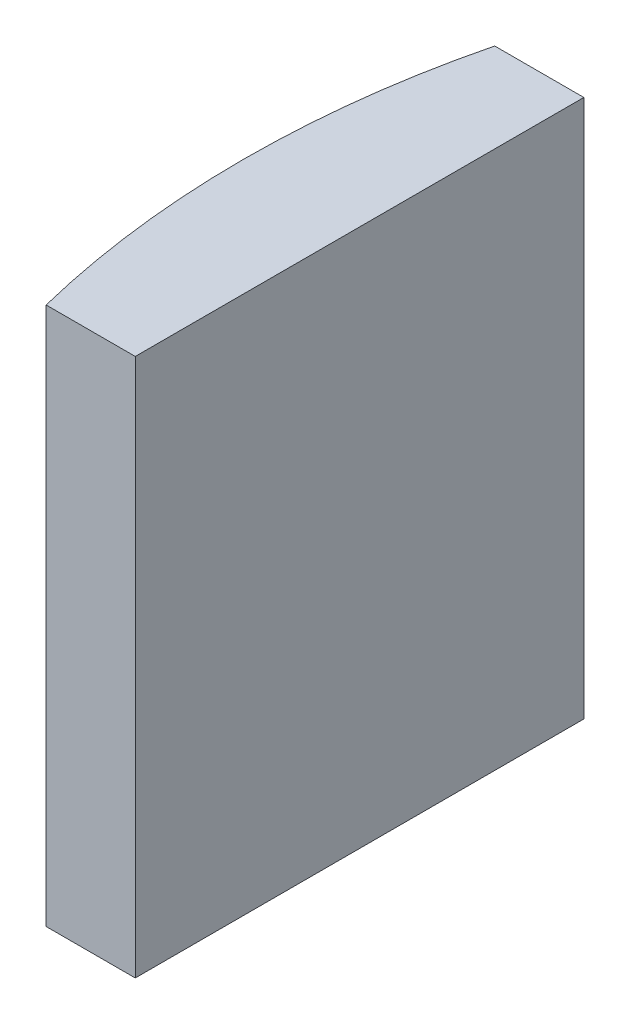
ISO-10303-21;
HEADER;
FILE_DESCRIPTION(('STEP AP214'),'2;1');
FILE_NAME('part.step','',(''),(''),'','','');
FILE_SCHEMA(('AUTOMOTIVE_DESIGN { 1 0 10303 214 1 1 1 1 }'));
ENDSEC;
DATA;
#1=APPLICATION_CONTEXT('core data for automotive mechanical design processes');
#2=APPLICATION_PROTOCOL_DEFINITION('international standard','automotive_design',2000,#1);
#3=PRODUCT_CONTEXT('',#1,'mechanical');
#4=PRODUCT('Part','Part','',(#3));
#5=PRODUCT_RELATED_PRODUCT_CATEGORY('part','',(#4));
#6=PRODUCT_DEFINITION_FORMATION('','',#4);
#7=PRODUCT_DEFINITION_CONTEXT('part definition',#1,'design');
#8=PRODUCT_DEFINITION('design','',#6,#7);
#9=PRODUCT_DEFINITION_SHAPE('','',#8);
#10=(LENGTH_UNIT() NAMED_UNIT(*) SI_UNIT(.MILLI.,.METRE.));
#11=(NAMED_UNIT(*) PLANE_ANGLE_UNIT() SI_UNIT($,.RADIAN.));
#12=(NAMED_UNIT(*) SI_UNIT($,.STERADIAN.) SOLID_ANGLE_UNIT());
#13=UNCERTAINTY_MEASURE_WITH_UNIT(LENGTH_MEASURE(1.E-05),#10,'distance_accuracy_value','');
#14=(GEOMETRIC_REPRESENTATION_CONTEXT(3) GLOBAL_UNCERTAINTY_ASSIGNED_CONTEXT((#13)) GLOBAL_UNIT_ASSIGNED_CONTEXT((#10,
#11,#12)) REPRESENTATION_CONTEXT('',''));
#15=CARTESIAN_POINT('',(0.,0.,0.));
#16=DIRECTION('',(0.,0.,1.));
#17=DIRECTION('',(1.,0.,0.));
#18=AXIS2_PLACEMENT_3D('',#15,#16,#17);
#19=CARTESIAN_POINT('',(4.35520433485127,12.,0.));
#20=DIRECTION('',(0.,-1.,0.));
#21=DIRECTION('',(0.,0.,-1.));
#22=AXIS2_PLACEMENT_3D('',#19,#20,#21);
#23=CYLINDRICAL_SURFACE('',#22,20.68);
#24=CARTESIAN_POINT('',(4.35520433485127,0.,0.));
#25=DIRECTION('',(0.,1.,0.));
#26=DIRECTION('',(0.,0.,1.));
#27=AXIS2_PLACEMENT_3D('',#24,#25,#26);
#28=CIRCLE('',#27,20.68);
#29=CARTESIAN_POINT('',(-15.7112452763779,0.,-5.));
#30=VERTEX_POINT('',#29);
#31=CARTESIAN_POINT('',(-15.7112452763779,0.,5.));
#32=VERTEX_POINT('',#31);
#33=EDGE_CURVE('E100',#30,#32,#28,.T.);
#34=ORIENTED_EDGE('',*,*,#33,.T.);
#35=DIRECTION('',(0.,-1.,0.));
#36=VECTOR('',#35,1.);
#37=CARTESIAN_POINT('',(-15.7112452763779,12.,5.));
#38=LINE('',#37,#36);
#39=CARTESIAN_POINT('',(-15.7112452763779,12.,5.));
#40=VERTEX_POINT('',#39);
#41=EDGE_CURVE('E11',#40,#32,#38,.T.);
#42=ORIENTED_EDGE('',*,*,#41,.F.);
#43=CARTESIAN_POINT('',(4.35520433485127,12.,0.));
#44=DIRECTION('',(0.,1.,0.));
#45=DIRECTION('',(0.,0.,1.));
#46=AXIS2_PLACEMENT_3D('',#43,#44,#45);
#47=CIRCLE('',#46,20.68);
#48=CARTESIAN_POINT('',(-15.7112452763779,12.,-5.));
#49=VERTEX_POINT('',#48);
#50=EDGE_CURVE('E88',#49,#40,#47,.T.);
#51=ORIENTED_EDGE('',*,*,#50,.F.);
#52=DIRECTION('',(0.,-1.,0.));
#53=VECTOR('',#52,1.);
#54=CARTESIAN_POINT('',(-15.7112452763779,12.,-5.));
#55=LINE('',#54,#53);
#56=EDGE_CURVE('E96',#49,#30,#55,.T.);
#57=ORIENTED_EDGE('',*,*,#56,.T.);
#58=EDGE_LOOP('',(#34,#42,#51,#57));
#59=FACE_BOUND('',#58,.T.);
#60=ADVANCED_FACE('F37',(#59),#23,.T.);
#61=CARTESIAN_POINT('',(-15.7112452763779,12.,5.));
#62=DIRECTION('',(0.,0.,-1.));
#63=DIRECTION('',(-1.,0.,0.));
#64=AXIS2_PLACEMENT_3D('',#61,#62,#63);
#65=PLANE('',#64);
#66=DIRECTION('',(1.,0.,0.));
#67=VECTOR('',#66,1.);
#68=CARTESIAN_POINT('',(-15.7112452763779,0.,5.));
#69=LINE('',#68,#67);
#70=CARTESIAN_POINT('',(-13.7247956651487,0.,5.));
#71=VERTEX_POINT('',#70);
#72=EDGE_CURVE('E92',#32,#71,#69,.T.);
#73=ORIENTED_EDGE('',*,*,#72,.T.);
#74=DIRECTION('',(0.,-1.,0.));
#75=VECTOR('',#74,1.);
#76=CARTESIAN_POINT('',(-13.7247956651487,12.,5.));
#77=LINE('',#76,#75);
#78=CARTESIAN_POINT('',(-13.7247956651487,12.,5.));
#79=VERTEX_POINT('',#78);
#80=EDGE_CURVE('E45',#79,#71,#77,.T.);
#81=ORIENTED_EDGE('',*,*,#80,.F.);
#82=DIRECTION('',(1.,0.,0.));
#83=VECTOR('',#82,1.);
#84=CARTESIAN_POINT('',(-15.7112452763779,12.,5.));
#85=LINE('',#84,#83);
#86=EDGE_CURVE('E83',#40,#79,#85,.T.);
#87=ORIENTED_EDGE('',*,*,#86,.F.);
#88=ORIENTED_EDGE('',*,*,#41,.T.);
#89=EDGE_LOOP('',(#73,#81,#87,#88));
#90=FACE_BOUND('',#89,.T.);
#91=ADVANCED_FACE('F91',(#90),#65,.F.);
#92=CARTESIAN_POINT('',(-13.7247956651487,12.,-5.));
#93=DIRECTION('',(-1.,0.,0.));
#94=DIRECTION('',(0.,0.,1.));
#95=AXIS2_PLACEMENT_3D('',#92,#93,#94);
#96=PLANE('',#95);
#97=DIRECTION('',(0.,0.,-1.));
#98=VECTOR('',#97,1.);
#99=CARTESIAN_POINT('',(-13.7247956651487,0.,-5.));
#100=LINE('',#99,#98);
#101=CARTESIAN_POINT('',(-13.7247956651487,0.,-5.));
#102=VERTEX_POINT('',#101);
#103=EDGE_CURVE('E70',#71,#102,#100,.T.);
#104=ORIENTED_EDGE('',*,*,#103,.T.);
#105=DIRECTION('',(0.,-1.,0.));
#106=VECTOR('',#105,1.);
#107=CARTESIAN_POINT('',(-13.7247956651487,12.,-5.));
#108=LINE('',#107,#106);
#109=CARTESIAN_POINT('',(-13.7247956651487,12.,-5.));
#110=VERTEX_POINT('',#109);
#111=EDGE_CURVE('E93',#110,#102,#108,.T.);
#112=ORIENTED_EDGE('',*,*,#111,.F.);
#113=DIRECTION('',(0.,0.,-1.));
#114=VECTOR('',#113,1.);
#115=CARTESIAN_POINT('',(-13.7247956651487,12.,-5.));
#116=LINE('',#115,#114);
#117=EDGE_CURVE('E86',#79,#110,#116,.T.);
#118=ORIENTED_EDGE('',*,*,#117,.F.);
#119=ORIENTED_EDGE('',*,*,#80,.T.);
#120=EDGE_LOOP('',(#104,#112,#118,#119));
#121=FACE_BOUND('',#120,.T.);
#122=ADVANCED_FACE('F94',(#121),#96,.F.);
#123=CARTESIAN_POINT('',(-15.7112452763779,12.,-5.));
#124=DIRECTION('',(0.,0.,1.));
#125=DIRECTION('',(1.,0.,0.));
#126=AXIS2_PLACEMENT_3D('',#123,#124,#125);
#127=PLANE('',#126);
#128=DIRECTION('',(-1.,0.,0.));
#129=VECTOR('',#128,1.);
#130=CARTESIAN_POINT('',(-15.7112452763779,0.,-5.));
#131=LINE('',#130,#129);
#132=EDGE_CURVE('E76',#102,#30,#131,.T.);
#133=ORIENTED_EDGE('',*,*,#132,.T.);
#134=ORIENTED_EDGE('',*,*,#56,.F.);
#135=DIRECTION('',(-1.,0.,0.));
#136=VECTOR('',#135,1.);
#137=CARTESIAN_POINT('',(-15.7112452763779,12.,-5.));
#138=LINE('',#137,#136);
#139=EDGE_CURVE('E53',#110,#49,#138,.T.);
#140=ORIENTED_EDGE('',*,*,#139,.F.);
#141=ORIENTED_EDGE('',*,*,#111,.T.);
#142=EDGE_LOOP('',(#133,#134,#140,#141));
#143=FACE_BOUND('',#142,.T.);
#144=ADVANCED_FACE('F107',(#143),#127,.F.);
#145=CARTESIAN_POINT('',(4.35520433485127,12.,0.));
#146=DIRECTION('',(0.,1.,0.));
#147=DIRECTION('',(0.,0.,1.));
#148=AXIS2_PLACEMENT_3D('',#145,#146,#147);
#149=PLANE('',#148);
#150=ORIENTED_EDGE('',*,*,#50,.T.);
#151=ORIENTED_EDGE('',*,*,#86,.T.);
#152=ORIENTED_EDGE('',*,*,#117,.T.);
#153=ORIENTED_EDGE('',*,*,#139,.T.);
#154=EDGE_LOOP('',(#150,#151,#152,#153));
#155=FACE_BOUND('',#154,.T.);
#156=ADVANCED_FACE('F84',(#155),#149,.T.);
#157=CARTESIAN_POINT('',(4.35520433485127,0.,0.));
#158=DIRECTION('',(0.,1.,0.));
#159=DIRECTION('',(0.,0.,1.));
#160=AXIS2_PLACEMENT_3D('',#157,#158,#159);
#161=PLANE('',#160);
#162=ORIENTED_EDGE('',*,*,#33,.F.);
#163=ORIENTED_EDGE('',*,*,#132,.F.);
#164=ORIENTED_EDGE('',*,*,#103,.F.);
#165=ORIENTED_EDGE('',*,*,#72,.F.);
#166=EDGE_LOOP('',(#162,#163,#164,#165));
#167=FACE_BOUND('',#166,.T.);
#168=ADVANCED_FACE('F110',(#167),#161,.F.);
#169=CLOSED_SHELL('',(#60,#91,#122,#144,#156,#168));
#170=MANIFOLD_SOLID_BREP('B2',#169);
#171=ADVANCED_BREP_SHAPE_REPRESENTATION('',(#18,#170),#14);
#172=SHAPE_DEFINITION_REPRESENTATION(#9,#171);
ENDSEC;
END-ISO-10303-21;
